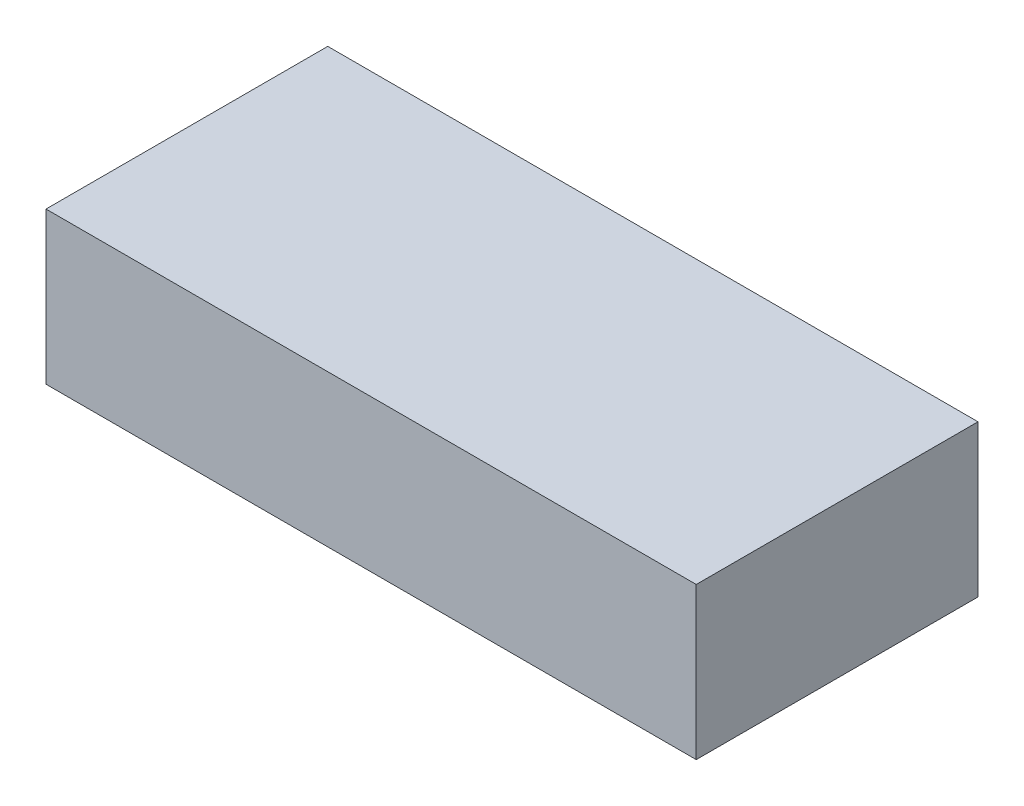
ISO-10303-21;
HEADER;
FILE_DESCRIPTION(('STEP AP214'),'2;1');
FILE_NAME('part.step','',(''),(''),'','','');
FILE_SCHEMA(('AUTOMOTIVE_DESIGN { 1 0 10303 214 1 1 1 1 }'));
ENDSEC;
DATA;
#1=APPLICATION_CONTEXT('core data for automotive mechanical design processes');
#2=APPLICATION_PROTOCOL_DEFINITION('international standard','automotive_design',2000,#1);
#3=PRODUCT_CONTEXT('',#1,'mechanical');
#4=PRODUCT('Part','Part','',(#3));
#5=PRODUCT_RELATED_PRODUCT_CATEGORY('part','',(#4));
#6=PRODUCT_DEFINITION_FORMATION('','',#4);
#7=PRODUCT_DEFINITION_CONTEXT('part definition',#1,'design');
#8=PRODUCT_DEFINITION('design','',#6,#7);
#9=PRODUCT_DEFINITION_SHAPE('','',#8);
#10=(LENGTH_UNIT() NAMED_UNIT(*) SI_UNIT(.MILLI.,.METRE.));
#11=(NAMED_UNIT(*) PLANE_ANGLE_UNIT() SI_UNIT($,.RADIAN.));
#12=(NAMED_UNIT(*) SI_UNIT($,.STERADIAN.) SOLID_ANGLE_UNIT());
#13=UNCERTAINTY_MEASURE_WITH_UNIT(LENGTH_MEASURE(1.E-05),#10,'distance_accuracy_value','');
#14=(GEOMETRIC_REPRESENTATION_CONTEXT(3) GLOBAL_UNCERTAINTY_ASSIGNED_CONTEXT((#13)) GLOBAL_UNIT_ASSIGNED_CONTEXT((#10,
#11,#12)) REPRESENTATION_CONTEXT('',''));
#15=CARTESIAN_POINT('',(0.,0.,0.));
#16=DIRECTION('',(0.,0.,1.));
#17=DIRECTION('',(1.,0.,0.));
#18=AXIS2_PLACEMENT_3D('',#15,#16,#17);
#19=CARTESIAN_POINT('',(75.,35.,32.5));
#20=DIRECTION('',(-1.,0.,0.));
#21=DIRECTION('',(0.,0.,1.));
#22=AXIS2_PLACEMENT_3D('',#19,#20,#21);
#23=PLANE('',#22);
#24=DIRECTION('',(0.,0.,-1.));
#25=VECTOR('',#24,1.);
#26=CARTESIAN_POINT('',(75.,0.,32.5));
#27=LINE('',#26,#25);
#28=CARTESIAN_POINT('',(75.,0.,32.5));
#29=VERTEX_POINT('',#28);
#30=CARTESIAN_POINT('',(75.,0.,-32.5));
#31=VERTEX_POINT('',#30);
#32=EDGE_CURVE('E161',#29,#31,#27,.T.);
#33=ORIENTED_EDGE('',*,*,#32,.T.);
#34=DIRECTION('',(0.,-1.,0.));
#35=VECTOR('',#34,1.);
#36=CARTESIAN_POINT('',(75.,35.,-32.5));
#37=LINE('',#36,#35);
#38=CARTESIAN_POINT('',(75.,35.,-32.5));
#39=VERTEX_POINT('',#38);
#40=EDGE_CURVE('E11',#39,#31,#37,.T.);
#41=ORIENTED_EDGE('',*,*,#40,.F.);
#42=DIRECTION('',(0.,0.,-1.));
#43=VECTOR('',#42,1.);
#44=CARTESIAN_POINT('',(75.,35.,32.5));
#45=LINE('',#44,#43);
#46=CARTESIAN_POINT('',(75.,35.,32.5));
#47=VERTEX_POINT('',#46);
#48=EDGE_CURVE('E167',#47,#39,#45,.T.);
#49=ORIENTED_EDGE('',*,*,#48,.F.);
#50=DIRECTION('',(0.,-1.,0.));
#51=VECTOR('',#50,1.);
#52=CARTESIAN_POINT('',(75.,35.,32.5));
#53=LINE('',#52,#51);
#54=EDGE_CURVE('E177',#47,#29,#53,.T.);
#55=ORIENTED_EDGE('',*,*,#54,.T.);
#56=EDGE_LOOP('',(#33,#41,#49,#55));
#57=FACE_BOUND('',#56,.T.);
#58=ADVANCED_FACE('F42',(#57),#23,.F.);
#59=CARTESIAN_POINT('',(-75.,35.,-32.5));
#60=DIRECTION('',(0.,0.,1.));
#61=DIRECTION('',(1.,0.,0.));
#62=AXIS2_PLACEMENT_3D('',#59,#60,#61);
#63=PLANE('',#62);
#64=DIRECTION('',(-1.,0.,0.));
#65=VECTOR('',#64,1.);
#66=CARTESIAN_POINT('',(-75.,0.,-32.5));
#67=LINE('',#66,#65);
#68=CARTESIAN_POINT('',(-75.,0.,-32.5));
#69=VERTEX_POINT('',#68);
#70=EDGE_CURVE('E181',#31,#69,#67,.T.);
#71=ORIENTED_EDGE('',*,*,#70,.T.);
#72=DIRECTION('',(0.,-1.,0.));
#73=VECTOR('',#72,1.);
#74=CARTESIAN_POINT('',(-75.,35.,-32.5));
#75=LINE('',#74,#73);
#76=CARTESIAN_POINT('',(-75.,35.,-32.5));
#77=VERTEX_POINT('',#76);
#78=EDGE_CURVE('E50',#77,#69,#75,.T.);
#79=ORIENTED_EDGE('',*,*,#78,.F.);
#80=DIRECTION('',(-1.,0.,0.));
#81=VECTOR('',#80,1.);
#82=CARTESIAN_POINT('',(-75.,35.,-32.5));
#83=LINE('',#82,#81);
#84=EDGE_CURVE('E94',#39,#77,#83,.T.);
#85=ORIENTED_EDGE('',*,*,#84,.F.);
#86=ORIENTED_EDGE('',*,*,#40,.T.);
#87=EDGE_LOOP('',(#71,#79,#85,#86));
#88=FACE_BOUND('',#87,.T.);
#89=ADVANCED_FACE('F215',(#88),#63,.F.);
#90=CARTESIAN_POINT('',(-75.,35.,32.5));
#91=DIRECTION('',(1.,0.,0.));
#92=DIRECTION('',(0.,0.,-1.));
#93=AXIS2_PLACEMENT_3D('',#90,#91,#92);
#94=PLANE('',#93);
#95=DIRECTION('',(0.,0.,1.));
#96=VECTOR('',#95,1.);
#97=CARTESIAN_POINT('',(-75.,0.,32.5));
#98=LINE('',#97,#96);
#99=CARTESIAN_POINT('',(-75.,0.,32.5));
#100=VERTEX_POINT('',#99);
#101=EDGE_CURVE('E184',#69,#100,#98,.T.);
#102=ORIENTED_EDGE('',*,*,#101,.T.);
#103=DIRECTION('',(0.,-1.,0.));
#104=VECTOR('',#103,1.);
#105=CARTESIAN_POINT('',(-75.,35.,32.5));
#106=LINE('',#105,#104);
#107=CARTESIAN_POINT('',(-75.,35.,32.5));
#108=VERTEX_POINT('',#107);
#109=EDGE_CURVE('E191',#108,#100,#106,.T.);
#110=ORIENTED_EDGE('',*,*,#109,.F.);
#111=DIRECTION('',(0.,0.,1.));
#112=VECTOR('',#111,1.);
#113=CARTESIAN_POINT('',(-75.,35.,32.5));
#114=LINE('',#113,#112);
#115=EDGE_CURVE('E172',#77,#108,#114,.T.);
#116=ORIENTED_EDGE('',*,*,#115,.F.);
#117=ORIENTED_EDGE('',*,*,#78,.T.);
#118=EDGE_LOOP('',(#102,#110,#116,#117));
#119=FACE_BOUND('',#118,.T.);
#120=ADVANCED_FACE('F198',(#119),#94,.F.);
#121=CARTESIAN_POINT('',(-75.,35.,32.5));
#122=DIRECTION('',(0.,0.,-1.));
#123=DIRECTION('',(-1.,0.,0.));
#124=AXIS2_PLACEMENT_3D('',#121,#122,#123);
#125=PLANE('',#124);
#126=DIRECTION('',(1.,0.,0.));
#127=VECTOR('',#126,1.);
#128=CARTESIAN_POINT('',(-75.,0.,32.5));
#129=LINE('',#128,#127);
#130=EDGE_CURVE('E87',#100,#29,#129,.T.);
#131=ORIENTED_EDGE('',*,*,#130,.T.);
#132=ORIENTED_EDGE('',*,*,#54,.F.);
#133=DIRECTION('',(1.,0.,0.));
#134=VECTOR('',#133,1.);
#135=CARTESIAN_POINT('',(-75.,35.,32.5));
#136=LINE('',#135,#134);
#137=EDGE_CURVE('E66',#108,#47,#136,.T.);
#138=ORIENTED_EDGE('',*,*,#137,.F.);
#139=ORIENTED_EDGE('',*,*,#109,.T.);
#140=EDGE_LOOP('',(#131,#132,#138,#139));
#141=FACE_BOUND('',#140,.T.);
#142=ADVANCED_FACE('F206',(#141),#125,.F.);
#143=CARTESIAN_POINT('',(0.,35.,0.));
#144=DIRECTION('',(0.,-1.,0.));
#145=DIRECTION('',(0.,0.,-1.));
#146=AXIS2_PLACEMENT_3D('',#143,#144,#145);
#147=PLANE('',#146);
#148=ORIENTED_EDGE('',*,*,#48,.T.);
#149=ORIENTED_EDGE('',*,*,#84,.T.);
#150=ORIENTED_EDGE('',*,*,#115,.T.);
#151=ORIENTED_EDGE('',*,*,#137,.T.);
#152=EDGE_LOOP('',(#148,#149,#150,#151));
#153=FACE_BOUND('',#152,.T.);
#154=ADVANCED_FACE('F208',(#153),#147,.F.);
#155=CARTESIAN_POINT('',(0.,0.,0.));
#156=DIRECTION('',(0.,-1.,0.));
#157=DIRECTION('',(0.,0.,-1.));
#158=AXIS2_PLACEMENT_3D('',#155,#156,#157);
#159=PLANE('',#158);
#160=DIRECTION('',(0.,0.,1.));
#161=VECTOR('',#160,1.);
#162=CARTESIAN_POINT('',(71.952,0.,-29.452));
#163=LINE('',#162,#161);
#164=CARTESIAN_POINT('',(71.952,0.,-29.452));
#165=VERTEX_POINT('',#164);
#166=CARTESIAN_POINT('',(71.952,0.,29.452));
#167=VERTEX_POINT('',#166);
#168=EDGE_CURVE('E57',#165,#167,#163,.T.);
#169=ORIENTED_EDGE('',*,*,#168,.F.);
#170=DIRECTION('',(1.,0.,0.));
#171=VECTOR('',#170,1.);
#172=CARTESIAN_POINT('',(-71.952,0.,-29.452));
#173=LINE('',#172,#171);
#174=CARTESIAN_POINT('',(-71.952,0.,-29.452));
#175=VERTEX_POINT('',#174);
#176=EDGE_CURVE('E139',#175,#165,#173,.T.);
#177=ORIENTED_EDGE('',*,*,#176,.F.);
#178=DIRECTION('',(0.,0.,-1.));
#179=VECTOR('',#178,1.);
#180=CARTESIAN_POINT('',(-71.952,0.,-29.452));
#181=LINE('',#180,#179);
#182=CARTESIAN_POINT('',(-71.952,0.,29.452));
#183=VERTEX_POINT('',#182);
#184=EDGE_CURVE('E143',#183,#175,#181,.T.);
#185=ORIENTED_EDGE('',*,*,#184,.F.);
#186=DIRECTION('',(-1.,0.,0.));
#187=VECTOR('',#186,1.);
#188=CARTESIAN_POINT('',(-71.952,0.,29.452));
#189=LINE('',#188,#187);
#190=EDGE_CURVE('E152',#167,#183,#189,.T.);
#191=ORIENTED_EDGE('',*,*,#190,.F.);
#192=EDGE_LOOP('',(#169,#177,#185,#191));
#193=FACE_BOUND('',#192,.T.);
#194=ORIENTED_EDGE('',*,*,#32,.F.);
#195=ORIENTED_EDGE('',*,*,#130,.F.);
#196=ORIENTED_EDGE('',*,*,#101,.F.);
#197=ORIENTED_EDGE('',*,*,#70,.F.);
#198=EDGE_LOOP('',(#194,#195,#196,#197));
#199=FACE_BOUND('',#198,.T.);
#200=ADVANCED_FACE('F202',(#193,#199),#159,.T.);
#201=CARTESIAN_POINT('',(71.952,28.4,-29.452));
#202=DIRECTION('',(1.,0.,0.));
#203=DIRECTION('',(0.,0.,-1.));
#204=AXIS2_PLACEMENT_3D('',#201,#202,#203);
#205=PLANE('',#204);
#206=ORIENTED_EDGE('',*,*,#168,.T.);
#207=DIRECTION('',(0.,-1.,0.));
#208=VECTOR('',#207,1.);
#209=CARTESIAN_POINT('',(71.952,28.4,29.452));
#210=LINE('',#209,#208);
#211=CARTESIAN_POINT('',(71.952,28.4,29.452));
#212=VERTEX_POINT('',#211);
#213=EDGE_CURVE('E114',#212,#167,#210,.T.);
#214=ORIENTED_EDGE('',*,*,#213,.F.);
#215=DIRECTION('',(0.,0.,1.));
#216=VECTOR('',#215,1.);
#217=CARTESIAN_POINT('',(71.952,28.4,-29.452));
#218=LINE('',#217,#216);
#219=CARTESIAN_POINT('',(71.952,28.4,-29.452));
#220=VERTEX_POINT('',#219);
#221=EDGE_CURVE('E118',#220,#212,#218,.T.);
#222=ORIENTED_EDGE('',*,*,#221,.F.);
#223=DIRECTION('',(0.,-1.,0.));
#224=VECTOR('',#223,1.);
#225=CARTESIAN_POINT('',(71.952,28.4,-29.452));
#226=LINE('',#225,#224);
#227=EDGE_CURVE('E158',#220,#165,#226,.T.);
#228=ORIENTED_EDGE('',*,*,#227,.T.);
#229=EDGE_LOOP('',(#206,#214,#222,#228));
#230=FACE_BOUND('',#229,.T.);
#231=ADVANCED_FACE('F116',(#230),#205,.F.);
#232=CARTESIAN_POINT('',(-71.952,28.4,-29.452));
#233=DIRECTION('',(0.,0.,-1.));
#234=DIRECTION('',(-1.,0.,0.));
#235=AXIS2_PLACEMENT_3D('',#232,#233,#234);
#236=PLANE('',#235);
#237=ORIENTED_EDGE('',*,*,#176,.T.);
#238=ORIENTED_EDGE('',*,*,#227,.F.);
#239=DIRECTION('',(1.,0.,0.));
#240=VECTOR('',#239,1.);
#241=CARTESIAN_POINT('',(-71.952,28.4,-29.452));
#242=LINE('',#241,#240);
#243=CARTESIAN_POINT('',(-71.952,28.4,-29.452));
#244=VERTEX_POINT('',#243);
#245=EDGE_CURVE('E125',#244,#220,#242,.T.);
#246=ORIENTED_EDGE('',*,*,#245,.F.);
#247=DIRECTION('',(0.,-1.,0.));
#248=VECTOR('',#247,1.);
#249=CARTESIAN_POINT('',(-71.952,28.4,-29.452));
#250=LINE('',#249,#248);
#251=EDGE_CURVE('E162',#244,#175,#250,.T.);
#252=ORIENTED_EDGE('',*,*,#251,.T.);
#253=EDGE_LOOP('',(#237,#238,#246,#252));
#254=FACE_BOUND('',#253,.T.);
#255=ADVANCED_FACE('F259',(#254),#236,.F.);
#256=CARTESIAN_POINT('',(-71.952,28.4,-29.452));
#257=DIRECTION('',(-1.,0.,0.));
#258=DIRECTION('',(0.,0.,1.));
#259=AXIS2_PLACEMENT_3D('',#256,#257,#258);
#260=PLANE('',#259);
#261=ORIENTED_EDGE('',*,*,#184,.T.);
#262=ORIENTED_EDGE('',*,*,#251,.F.);
#263=DIRECTION('',(0.,0.,-1.));
#264=VECTOR('',#263,1.);
#265=CARTESIAN_POINT('',(-71.952,28.4,-29.452));
#266=LINE('',#265,#264);
#267=CARTESIAN_POINT('',(-71.952,28.4,29.452));
#268=VERTEX_POINT('',#267);
#269=EDGE_CURVE('E134',#268,#244,#266,.T.);
#270=ORIENTED_EDGE('',*,*,#269,.F.);
#271=DIRECTION('',(0.,-1.,0.));
#272=VECTOR('',#271,1.);
#273=CARTESIAN_POINT('',(-71.952,28.4,29.452));
#274=LINE('',#273,#272);
#275=EDGE_CURVE('E124',#268,#183,#274,.T.);
#276=ORIENTED_EDGE('',*,*,#275,.T.);
#277=EDGE_LOOP('',(#261,#262,#270,#276));
#278=FACE_BOUND('',#277,.T.);
#279=ADVANCED_FACE('F269',(#278),#260,.F.);
#280=CARTESIAN_POINT('',(-71.952,28.4,29.452));
#281=DIRECTION('',(0.,0.,1.));
#282=DIRECTION('',(1.,0.,0.));
#283=AXIS2_PLACEMENT_3D('',#280,#281,#282);
#284=PLANE('',#283);
#285=ORIENTED_EDGE('',*,*,#190,.T.);
#286=ORIENTED_EDGE('',*,*,#275,.F.);
#287=DIRECTION('',(-1.,0.,0.));
#288=VECTOR('',#287,1.);
#289=CARTESIAN_POINT('',(-71.952,28.4,29.452));
#290=LINE('',#289,#288);
#291=EDGE_CURVE('E128',#212,#268,#290,.T.);
#292=ORIENTED_EDGE('',*,*,#291,.F.);
#293=ORIENTED_EDGE('',*,*,#213,.T.);
#294=EDGE_LOOP('',(#285,#286,#292,#293));
#295=FACE_BOUND('',#294,.T.);
#296=ADVANCED_FACE('F129',(#295),#284,.F.);
#297=CARTESIAN_POINT('',(0.,28.4,0.));
#298=DIRECTION('',(0.,1.,0.));
#299=DIRECTION('',(0.,0.,1.));
#300=AXIS2_PLACEMENT_3D('',#297,#298,#299);
#301=PLANE('',#300);
#302=ORIENTED_EDGE('',*,*,#221,.T.);
#303=ORIENTED_EDGE('',*,*,#291,.T.);
#304=ORIENTED_EDGE('',*,*,#269,.T.);
#305=ORIENTED_EDGE('',*,*,#245,.T.);
#306=EDGE_LOOP('',(#302,#303,#304,#305));
#307=FACE_BOUND('',#306,.T.);
#308=ADVANCED_FACE('F136',(#307),#301,.F.);
#309=CLOSED_SHELL('',(#58,#89,#120,#142,#154,#200,#231,#255,#279,#296,#308));
#310=MANIFOLD_SOLID_BREP('B2',#309);
#311=ADVANCED_BREP_SHAPE_REPRESENTATION('',(#18,#310),#14);
#312=SHAPE_DEFINITION_REPRESENTATION(#9,#311);
ENDSEC;
END-ISO-10303-21;
